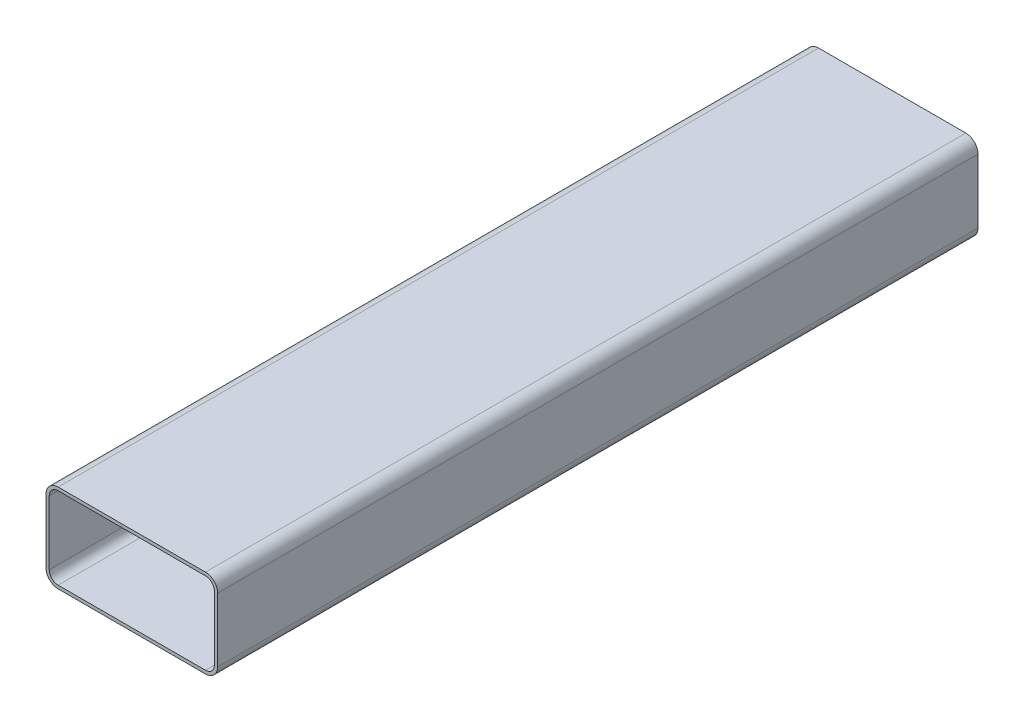
ISO-10303-21;
HEADER;
FILE_DESCRIPTION(('STEP AP214'),'2;1');
FILE_NAME('part.step','',(''),(''),'','','');
FILE_SCHEMA(('AUTOMOTIVE_DESIGN { 1 0 10303 214 1 1 1 1 }'));
ENDSEC;
DATA;
#1=APPLICATION_CONTEXT('core data for automotive mechanical design processes');
#2=APPLICATION_PROTOCOL_DEFINITION('international standard','automotive_design',2000,#1);
#3=PRODUCT_CONTEXT('',#1,'mechanical');
#4=PRODUCT('Part','Part','',(#3));
#5=PRODUCT_RELATED_PRODUCT_CATEGORY('part','',(#4));
#6=PRODUCT_DEFINITION_FORMATION('','',#4);
#7=PRODUCT_DEFINITION_CONTEXT('part definition',#1,'design');
#8=PRODUCT_DEFINITION('design','',#6,#7);
#9=PRODUCT_DEFINITION_SHAPE('','',#8);
#10=(LENGTH_UNIT() NAMED_UNIT(*) SI_UNIT(.MILLI.,.METRE.));
#11=(NAMED_UNIT(*) PLANE_ANGLE_UNIT() SI_UNIT($,.RADIAN.));
#12=(NAMED_UNIT(*) SI_UNIT($,.STERADIAN.) SOLID_ANGLE_UNIT());
#13=UNCERTAINTY_MEASURE_WITH_UNIT(LENGTH_MEASURE(1.E-05),#10,'distance_accuracy_value','');
#14=(GEOMETRIC_REPRESENTATION_CONTEXT(3) GLOBAL_UNCERTAINTY_ASSIGNED_CONTEXT((#13)) GLOBAL_UNIT_ASSIGNED_CONTEXT((#10,
#11,#12)) REPRESENTATION_CONTEXT('',''));
#15=CARTESIAN_POINT('',(0.,0.,0.));
#16=DIRECTION('',(0.,0.,1.));
#17=DIRECTION('',(1.,0.,0.));
#18=AXIS2_PLACEMENT_3D('',#15,#16,#17);
#19=CARTESIAN_POINT('',(49.2151,-21.364,508.));
#20=DIRECTION('',(0.,0.,1.));
#21=DIRECTION('',(1.,0.,0.));
#22=AXIS2_PLACEMENT_3D('',#19,#20,#21);
#23=PLANE('',#22);
#24=CARTESIAN_POINT('',(49.2151,-21.364,508.));
#25=DIRECTION('',(0.,0.,1.));
#26=DIRECTION('',(1.,0.,0.));
#27=AXIS2_PLACEMENT_3D('',#24,#25,#26);
#28=CIRCLE('',#27,8.10000000000001);
#29=CARTESIAN_POINT('',(49.2151,-29.464,508.));
#30=VERTEX_POINT('',#29);
#31=CARTESIAN_POINT('',(57.3151,-21.364,508.));
#32=VERTEX_POINT('',#31);
#33=EDGE_CURVE('E212',#30,#32,#28,.T.);
#34=ORIENTED_EDGE('',*,*,#33,.T.);
#35=DIRECTION('',(0.,1.,0.));
#36=VECTOR('',#35,1.);
#37=CARTESIAN_POINT('',(57.3151,-21.364,508.));
#38=LINE('',#37,#36);
#39=CARTESIAN_POINT('',(57.3151,21.364,508.));
#40=VERTEX_POINT('',#39);
#41=EDGE_CURVE('E215',#32,#40,#38,.T.);
#42=ORIENTED_EDGE('',*,*,#41,.T.);
#43=CARTESIAN_POINT('',(49.2151,21.364,508.));
#44=DIRECTION('',(0.,0.,1.));
#45=DIRECTION('',(-1.,0.,0.));
#46=AXIS2_PLACEMENT_3D('',#43,#44,#45);
#47=CIRCLE('',#46,8.10000000000001);
#48=CARTESIAN_POINT('',(49.2151,29.464,508.));
#49=VERTEX_POINT('',#48);
#50=EDGE_CURVE('E218',#40,#49,#47,.T.);
#51=ORIENTED_EDGE('',*,*,#50,.T.);
#52=DIRECTION('',(-1.,0.,0.));
#53=VECTOR('',#52,1.);
#54=CARTESIAN_POINT('',(-49.2151,29.464,508.));
#55=LINE('',#54,#53);
#56=CARTESIAN_POINT('',(-49.2151,29.464,508.));
#57=VERTEX_POINT('',#56);
#58=EDGE_CURVE('E220',#49,#57,#55,.T.);
#59=ORIENTED_EDGE('',*,*,#58,.T.);
#60=CARTESIAN_POINT('',(-49.2151,21.364,508.));
#61=DIRECTION('',(0.,0.,1.));
#62=DIRECTION('',(-1.,0.,0.));
#63=AXIS2_PLACEMENT_3D('',#60,#61,#62);
#64=CIRCLE('',#63,8.1);
#65=CARTESIAN_POINT('',(-57.3151,21.364,508.));
#66=VERTEX_POINT('',#65);
#67=EDGE_CURVE('E222',#57,#66,#64,.T.);
#68=ORIENTED_EDGE('',*,*,#67,.T.);
#69=DIRECTION('',(0.,-1.,0.));
#70=VECTOR('',#69,1.);
#71=CARTESIAN_POINT('',(-57.3151,-21.364,508.));
#72=LINE('',#71,#70);
#73=CARTESIAN_POINT('',(-57.3151,-21.364,508.));
#74=VERTEX_POINT('',#73);
#75=EDGE_CURVE('E224',#66,#74,#72,.T.);
#76=ORIENTED_EDGE('',*,*,#75,.T.);
#77=CARTESIAN_POINT('',(-49.2151,-21.364,508.));
#78=DIRECTION('',(0.,0.,1.));
#79=DIRECTION('',(-1.,0.,0.));
#80=AXIS2_PLACEMENT_3D('',#77,#78,#79);
#81=CIRCLE('',#80,8.1);
#82=CARTESIAN_POINT('',(-49.2151,-29.464,508.));
#83=VERTEX_POINT('',#82);
#84=EDGE_CURVE('E226',#74,#83,#81,.T.);
#85=ORIENTED_EDGE('',*,*,#84,.T.);
#86=DIRECTION('',(1.,0.,0.));
#87=VECTOR('',#86,1.);
#88=CARTESIAN_POINT('',(-49.2151,-29.464,508.));
#89=LINE('',#88,#87);
#90=EDGE_CURVE('E228',#83,#30,#89,.T.);
#91=ORIENTED_EDGE('',*,*,#90,.T.);
#92=EDGE_LOOP('',(#34,#42,#51,#59,#68,#76,#85,#91));
#93=FACE_BOUND('',#92,.T.);
#94=DIRECTION('',(0.,1.,0.));
#95=VECTOR('',#94,1.);
#96=CARTESIAN_POINT('',(55.1561,-21.365,508.));
#97=LINE('',#96,#95);
#98=CARTESIAN_POINT('',(55.1561,-21.365,508.));
#99=VERTEX_POINT('',#98);
#100=CARTESIAN_POINT('',(55.1561,21.365,508.));
#101=VERTEX_POINT('',#100);
#102=EDGE_CURVE('E155',#99,#101,#97,.T.);
#103=ORIENTED_EDGE('',*,*,#102,.F.);
#104=CARTESIAN_POINT('',(49.2161,-21.365,508.));
#105=DIRECTION('',(0.,0.,1.));
#106=DIRECTION('',(1.,0.,0.));
#107=AXIS2_PLACEMENT_3D('',#104,#105,#106);
#108=CIRCLE('',#107,5.94);
#109=CARTESIAN_POINT('',(49.2161,-27.305,508.));
#110=VERTEX_POINT('',#109);
#111=EDGE_CURVE('E147',#110,#99,#108,.T.);
#112=ORIENTED_EDGE('',*,*,#111,.F.);
#113=DIRECTION('',(1.,0.,0.));
#114=VECTOR('',#113,1.);
#115=CARTESIAN_POINT('',(-49.2161,-27.305,508.));
#116=LINE('',#115,#114);
#117=CARTESIAN_POINT('',(-49.2161,-27.305,508.));
#118=VERTEX_POINT('',#117);
#119=EDGE_CURVE('E180',#118,#110,#116,.T.);
#120=ORIENTED_EDGE('',*,*,#119,.F.);
#121=CARTESIAN_POINT('',(-49.2161,-21.365,508.));
#122=DIRECTION('',(0.,0.,1.));
#123=DIRECTION('',(-1.,0.,0.));
#124=AXIS2_PLACEMENT_3D('',#121,#122,#123);
#125=CIRCLE('',#124,5.94);
#126=CARTESIAN_POINT('',(-55.1561,-21.365,508.));
#127=VERTEX_POINT('',#126);
#128=EDGE_CURVE('E178',#127,#118,#125,.T.);
#129=ORIENTED_EDGE('',*,*,#128,.F.);
#130=DIRECTION('',(0.,-1.,0.));
#131=VECTOR('',#130,1.);
#132=CARTESIAN_POINT('',(-55.1561,-21.365,508.));
#133=LINE('',#132,#131);
#134=CARTESIAN_POINT('',(-55.1561,21.365,508.));
#135=VERTEX_POINT('',#134);
#136=EDGE_CURVE('E176',#135,#127,#133,.T.);
#137=ORIENTED_EDGE('',*,*,#136,.F.);
#138=CARTESIAN_POINT('',(-49.2161,21.365,508.));
#139=DIRECTION('',(0.,0.,1.));
#140=DIRECTION('',(-1.,0.,0.));
#141=AXIS2_PLACEMENT_3D('',#138,#139,#140);
#142=CIRCLE('',#141,5.94);
#143=CARTESIAN_POINT('',(-49.2161,27.305,508.));
#144=VERTEX_POINT('',#143);
#145=EDGE_CURVE('E174',#144,#135,#142,.T.);
#146=ORIENTED_EDGE('',*,*,#145,.F.);
#147=DIRECTION('',(-1.,0.,0.));
#148=VECTOR('',#147,1.);
#149=CARTESIAN_POINT('',(-49.2161,27.305,508.));
#150=LINE('',#149,#148);
#151=CARTESIAN_POINT('',(49.2161,27.305,508.));
#152=VERTEX_POINT('',#151);
#153=EDGE_CURVE('E170',#152,#144,#150,.T.);
#154=ORIENTED_EDGE('',*,*,#153,.F.);
#155=CARTESIAN_POINT('',(49.2161,21.365,508.));
#156=DIRECTION('',(0.,0.,1.));
#157=DIRECTION('',(-1.,0.,0.));
#158=AXIS2_PLACEMENT_3D('',#155,#156,#157);
#159=CIRCLE('',#158,5.94);
#160=EDGE_CURVE('E168',#101,#152,#159,.T.);
#161=ORIENTED_EDGE('',*,*,#160,.F.);
#162=EDGE_LOOP('',(#103,#112,#120,#129,#137,#146,#154,#161));
#163=FACE_BOUND('',#162,.T.);
#164=ADVANCED_FACE('F34',(#93,#163),#23,.T.);
#165=CARTESIAN_POINT('',(49.2151,-21.364,0.));
#166=DIRECTION('',(0.,0.,1.));
#167=DIRECTION('',(1.,0.,0.));
#168=AXIS2_PLACEMENT_3D('',#165,#166,#167);
#169=PLANE('',#168);
#170=CARTESIAN_POINT('',(49.2151,-21.364,0.));
#171=DIRECTION('',(0.,0.,1.));
#172=DIRECTION('',(1.,0.,0.));
#173=AXIS2_PLACEMENT_3D('',#170,#171,#172);
#174=CIRCLE('',#173,8.10000000000001);
#175=CARTESIAN_POINT('',(49.2151,-29.464,0.));
#176=VERTEX_POINT('',#175);
#177=CARTESIAN_POINT('',(57.3151,-21.364,0.));
#178=VERTEX_POINT('',#177);
#179=EDGE_CURVE('E163',#176,#178,#174,.T.);
#180=ORIENTED_EDGE('',*,*,#179,.F.);
#181=DIRECTION('',(1.,0.,0.));
#182=VECTOR('',#181,1.);
#183=CARTESIAN_POINT('',(-49.2151,-29.464,0.));
#184=LINE('',#183,#182);
#185=CARTESIAN_POINT('',(-49.2151,-29.464,0.));
#186=VERTEX_POINT('',#185);
#187=EDGE_CURVE('E216',#186,#176,#184,.T.);
#188=ORIENTED_EDGE('',*,*,#187,.F.);
#189=CARTESIAN_POINT('',(-49.2151,-21.364,0.));
#190=DIRECTION('',(0.,0.,1.));
#191=DIRECTION('',(-1.,0.,0.));
#192=AXIS2_PLACEMENT_3D('',#189,#190,#191);
#193=CIRCLE('',#192,8.1);
#194=CARTESIAN_POINT('',(-57.3151,-21.364,0.));
#195=VERTEX_POINT('',#194);
#196=EDGE_CURVE('E243',#195,#186,#193,.T.);
#197=ORIENTED_EDGE('',*,*,#196,.F.);
#198=DIRECTION('',(0.,-1.,0.));
#199=VECTOR('',#198,1.);
#200=CARTESIAN_POINT('',(-57.3151,-21.364,0.));
#201=LINE('',#200,#199);
#202=CARTESIAN_POINT('',(-57.3151,21.364,0.));
#203=VERTEX_POINT('',#202);
#204=EDGE_CURVE('E241',#203,#195,#201,.T.);
#205=ORIENTED_EDGE('',*,*,#204,.F.);
#206=CARTESIAN_POINT('',(-49.2151,21.364,0.));
#207=DIRECTION('',(0.,0.,1.));
#208=DIRECTION('',(-1.,0.,0.));
#209=AXIS2_PLACEMENT_3D('',#206,#207,#208);
#210=CIRCLE('',#209,8.1);
#211=CARTESIAN_POINT('',(-49.2151,29.464,0.));
#212=VERTEX_POINT('',#211);
#213=EDGE_CURVE('E239',#212,#203,#210,.T.);
#214=ORIENTED_EDGE('',*,*,#213,.F.);
#215=DIRECTION('',(-1.,0.,0.));
#216=VECTOR('',#215,1.);
#217=CARTESIAN_POINT('',(-49.2151,29.464,0.));
#218=LINE('',#217,#216);
#219=CARTESIAN_POINT('',(49.2151,29.464,0.));
#220=VERTEX_POINT('',#219);
#221=EDGE_CURVE('E237',#220,#212,#218,.T.);
#222=ORIENTED_EDGE('',*,*,#221,.F.);
#223=CARTESIAN_POINT('',(49.2151,21.364,0.));
#224=DIRECTION('',(0.,0.,1.));
#225=DIRECTION('',(-1.,0.,0.));
#226=AXIS2_PLACEMENT_3D('',#223,#224,#225);
#227=CIRCLE('',#226,8.10000000000001);
#228=CARTESIAN_POINT('',(57.3151,21.364,0.));
#229=VERTEX_POINT('',#228);
#230=EDGE_CURVE('E235',#229,#220,#227,.T.);
#231=ORIENTED_EDGE('',*,*,#230,.F.);
#232=DIRECTION('',(0.,1.,0.));
#233=VECTOR('',#232,1.);
#234=CARTESIAN_POINT('',(57.3151,-21.364,0.));
#235=LINE('',#234,#233);
#236=EDGE_CURVE('E233',#178,#229,#235,.T.);
#237=ORIENTED_EDGE('',*,*,#236,.F.);
#238=EDGE_LOOP('',(#180,#188,#197,#205,#214,#222,#231,#237));
#239=FACE_BOUND('',#238,.T.);
#240=CARTESIAN_POINT('',(49.2161,-21.365,0.));
#241=DIRECTION('',(0.,0.,1.));
#242=DIRECTION('',(1.,0.,0.));
#243=AXIS2_PLACEMENT_3D('',#240,#241,#242);
#244=CIRCLE('',#243,5.94);
#245=CARTESIAN_POINT('',(49.2161,-27.305,0.));
#246=VERTEX_POINT('',#245);
#247=CARTESIAN_POINT('',(55.1561,-21.365,0.));
#248=VERTEX_POINT('',#247);
#249=EDGE_CURVE('E57',#246,#248,#244,.T.);
#250=ORIENTED_EDGE('',*,*,#249,.T.);
#251=DIRECTION('',(0.,1.,0.));
#252=VECTOR('',#251,1.);
#253=CARTESIAN_POINT('',(55.1561,-21.365,0.));
#254=LINE('',#253,#252);
#255=CARTESIAN_POINT('',(55.1561,21.365,0.));
#256=VERTEX_POINT('',#255);
#257=EDGE_CURVE('E162',#248,#256,#254,.T.);
#258=ORIENTED_EDGE('',*,*,#257,.T.);
#259=CARTESIAN_POINT('',(49.2161,21.365,0.));
#260=DIRECTION('',(0.,0.,1.));
#261=DIRECTION('',(-1.,0.,0.));
#262=AXIS2_PLACEMENT_3D('',#259,#260,#261);
#263=CIRCLE('',#262,5.94);
#264=CARTESIAN_POINT('',(49.2161,27.305,0.));
#265=VERTEX_POINT('',#264);
#266=EDGE_CURVE('E184',#256,#265,#263,.T.);
#267=ORIENTED_EDGE('',*,*,#266,.T.);
#268=DIRECTION('',(-1.,0.,0.));
#269=VECTOR('',#268,1.);
#270=CARTESIAN_POINT('',(-49.2161,27.305,0.));
#271=LINE('',#270,#269);
#272=CARTESIAN_POINT('',(-49.2161,27.305,0.));
#273=VERTEX_POINT('',#272);
#274=EDGE_CURVE('E187',#265,#273,#271,.T.);
#275=ORIENTED_EDGE('',*,*,#274,.T.);
#276=CARTESIAN_POINT('',(-49.2161,21.365,0.));
#277=DIRECTION('',(0.,0.,1.));
#278=DIRECTION('',(-1.,0.,0.));
#279=AXIS2_PLACEMENT_3D('',#276,#277,#278);
#280=CIRCLE('',#279,5.94);
#281=CARTESIAN_POINT('',(-55.1561,21.365,0.));
#282=VERTEX_POINT('',#281);
#283=EDGE_CURVE('E190',#273,#282,#280,.T.);
#284=ORIENTED_EDGE('',*,*,#283,.T.);
#285=DIRECTION('',(0.,-1.,0.));
#286=VECTOR('',#285,1.);
#287=CARTESIAN_POINT('',(-55.1561,-21.365,0.));
#288=LINE('',#287,#286);
#289=CARTESIAN_POINT('',(-55.1561,-21.365,0.));
#290=VERTEX_POINT('',#289);
#291=EDGE_CURVE('E193',#282,#290,#288,.T.);
#292=ORIENTED_EDGE('',*,*,#291,.T.);
#293=CARTESIAN_POINT('',(-49.2161,-21.365,0.));
#294=DIRECTION('',(0.,0.,1.));
#295=DIRECTION('',(-1.,0.,0.));
#296=AXIS2_PLACEMENT_3D('',#293,#294,#295);
#297=CIRCLE('',#296,5.94);
#298=CARTESIAN_POINT('',(-49.2161,-27.305,0.));
#299=VERTEX_POINT('',#298);
#300=EDGE_CURVE('E196',#290,#299,#297,.T.);
#301=ORIENTED_EDGE('',*,*,#300,.T.);
#302=DIRECTION('',(1.,0.,0.));
#303=VECTOR('',#302,1.);
#304=CARTESIAN_POINT('',(-49.2161,-27.305,0.));
#305=LINE('',#304,#303);
#306=EDGE_CURVE('E156',#299,#246,#305,.T.);
#307=ORIENTED_EDGE('',*,*,#306,.T.);
#308=EDGE_LOOP('',(#250,#258,#267,#275,#284,#292,#301,#307));
#309=FACE_BOUND('',#308,.T.);
#310=ADVANCED_FACE('F273',(#239,#309),#169,.F.);
#311=CARTESIAN_POINT('',(49.2151,-21.364,508.));
#312=DIRECTION('',(0.,0.,-1.));
#313=DIRECTION('',(-1.,0.,0.));
#314=AXIS2_PLACEMENT_3D('',#311,#312,#313);
#315=CYLINDRICAL_SURFACE('',#314,8.10000000000001);
#316=ORIENTED_EDGE('',*,*,#179,.T.);
#317=DIRECTION('',(0.,0.,-1.));
#318=VECTOR('',#317,1.);
#319=CARTESIAN_POINT('',(57.3151,-21.364,508.));
#320=LINE('',#319,#318);
#321=EDGE_CURVE('E11',#32,#178,#320,.T.);
#322=ORIENTED_EDGE('',*,*,#321,.F.);
#323=ORIENTED_EDGE('',*,*,#33,.F.);
#324=DIRECTION('',(0.,0.,-1.));
#325=VECTOR('',#324,1.);
#326=CARTESIAN_POINT('',(49.2151,-29.464,508.));
#327=LINE('',#326,#325);
#328=EDGE_CURVE('E230',#30,#176,#327,.T.);
#329=ORIENTED_EDGE('',*,*,#328,.T.);
#330=EDGE_LOOP('',(#316,#322,#323,#329));
#331=FACE_BOUND('',#330,.T.);
#332=ADVANCED_FACE('F36',(#331),#315,.T.);
#333=CARTESIAN_POINT('',(57.3151,-21.364,508.));
#334=DIRECTION('',(-1.,0.,0.));
#335=DIRECTION('',(0.,0.,1.));
#336=AXIS2_PLACEMENT_3D('',#333,#334,#335);
#337=PLANE('',#336);
#338=ORIENTED_EDGE('',*,*,#236,.T.);
#339=DIRECTION('',(0.,0.,-1.));
#340=VECTOR('',#339,1.);
#341=CARTESIAN_POINT('',(57.3151,21.364,508.));
#342=LINE('',#341,#340);
#343=EDGE_CURVE('E42',#40,#229,#342,.T.);
#344=ORIENTED_EDGE('',*,*,#343,.F.);
#345=ORIENTED_EDGE('',*,*,#41,.F.);
#346=ORIENTED_EDGE('',*,*,#321,.T.);
#347=EDGE_LOOP('',(#338,#344,#345,#346));
#348=FACE_BOUND('',#347,.T.);
#349=ADVANCED_FACE('F290',(#348),#337,.F.);
#350=CARTESIAN_POINT('',(49.2151,21.364,508.));
#351=DIRECTION('',(0.,0.,-1.));
#352=DIRECTION('',(-1.,0.,0.));
#353=AXIS2_PLACEMENT_3D('',#350,#351,#352);
#354=CYLINDRICAL_SURFACE('',#353,8.10000000000001);
#355=ORIENTED_EDGE('',*,*,#230,.T.);
#356=DIRECTION('',(0.,0.,-1.));
#357=VECTOR('',#356,1.);
#358=CARTESIAN_POINT('',(49.2151,29.464,508.));
#359=LINE('',#358,#357);
#360=EDGE_CURVE('E260',#49,#220,#359,.T.);
#361=ORIENTED_EDGE('',*,*,#360,.F.);
#362=ORIENTED_EDGE('',*,*,#50,.F.);
#363=ORIENTED_EDGE('',*,*,#343,.T.);
#364=EDGE_LOOP('',(#355,#361,#362,#363));
#365=FACE_BOUND('',#364,.T.);
#366=ADVANCED_FACE('F267',(#365),#354,.T.);
#367=CARTESIAN_POINT('',(-49.2151,29.464,508.));
#368=DIRECTION('',(0.,-1.,0.));
#369=DIRECTION('',(1.,0.,0.));
#370=AXIS2_PLACEMENT_3D('',#367,#368,#369);
#371=PLANE('',#370);
#372=ORIENTED_EDGE('',*,*,#221,.T.);
#373=DIRECTION('',(0.,0.,-1.));
#374=VECTOR('',#373,1.);
#375=CARTESIAN_POINT('',(-49.2151,29.464,508.));
#376=LINE('',#375,#374);
#377=EDGE_CURVE('E257',#57,#212,#376,.T.);
#378=ORIENTED_EDGE('',*,*,#377,.F.);
#379=ORIENTED_EDGE('',*,*,#58,.F.);
#380=ORIENTED_EDGE('',*,*,#360,.T.);
#381=EDGE_LOOP('',(#372,#378,#379,#380));
#382=FACE_BOUND('',#381,.T.);
#383=ADVANCED_FACE('F279',(#382),#371,.F.);
#384=CARTESIAN_POINT('',(-49.2151,21.364,508.));
#385=DIRECTION('',(0.,0.,-1.));
#386=DIRECTION('',(-1.,0.,0.));
#387=AXIS2_PLACEMENT_3D('',#384,#385,#386);
#388=CYLINDRICAL_SURFACE('',#387,8.1);
#389=ORIENTED_EDGE('',*,*,#213,.T.);
#390=DIRECTION('',(0.,0.,-1.));
#391=VECTOR('',#390,1.);
#392=CARTESIAN_POINT('',(-57.3151,21.364,508.));
#393=LINE('',#392,#391);
#394=EDGE_CURVE('E254',#66,#203,#393,.T.);
#395=ORIENTED_EDGE('',*,*,#394,.F.);
#396=ORIENTED_EDGE('',*,*,#67,.F.);
#397=ORIENTED_EDGE('',*,*,#377,.T.);
#398=EDGE_LOOP('',(#389,#395,#396,#397));
#399=FACE_BOUND('',#398,.T.);
#400=ADVANCED_FACE('F283',(#399),#388,.T.);
#401=CARTESIAN_POINT('',(-57.3151,-21.364,508.));
#402=DIRECTION('',(1.,0.,0.));
#403=DIRECTION('',(0.,0.,-1.));
#404=AXIS2_PLACEMENT_3D('',#401,#402,#403);
#405=PLANE('',#404);
#406=ORIENTED_EDGE('',*,*,#204,.T.);
#407=DIRECTION('',(0.,0.,-1.));
#408=VECTOR('',#407,1.);
#409=CARTESIAN_POINT('',(-57.3151,-21.364,508.));
#410=LINE('',#409,#408);
#411=EDGE_CURVE('E251',#74,#195,#410,.T.);
#412=ORIENTED_EDGE('',*,*,#411,.F.);
#413=ORIENTED_EDGE('',*,*,#75,.F.);
#414=ORIENTED_EDGE('',*,*,#394,.T.);
#415=EDGE_LOOP('',(#406,#412,#413,#414));
#416=FACE_BOUND('',#415,.T.);
#417=ADVANCED_FACE('F303',(#416),#405,.F.);
#418=CARTESIAN_POINT('',(-49.2151,-21.364,508.));
#419=DIRECTION('',(0.,0.,-1.));
#420=DIRECTION('',(-1.,0.,0.));
#421=AXIS2_PLACEMENT_3D('',#418,#419,#420);
#422=CYLINDRICAL_SURFACE('',#421,8.1);
#423=ORIENTED_EDGE('',*,*,#196,.T.);
#424=DIRECTION('',(0.,0.,-1.));
#425=VECTOR('',#424,1.);
#426=CARTESIAN_POINT('',(-49.2151,-29.464,508.));
#427=LINE('',#426,#425);
#428=EDGE_CURVE('E248',#83,#186,#427,.T.);
#429=ORIENTED_EDGE('',*,*,#428,.F.);
#430=ORIENTED_EDGE('',*,*,#84,.F.);
#431=ORIENTED_EDGE('',*,*,#411,.T.);
#432=EDGE_LOOP('',(#423,#429,#430,#431));
#433=FACE_BOUND('',#432,.T.);
#434=ADVANCED_FACE('F301',(#433),#422,.T.);
#435=CARTESIAN_POINT('',(-49.2151,-29.464,508.));
#436=DIRECTION('',(0.,1.,0.));
#437=DIRECTION('',(0.,0.,1.));
#438=AXIS2_PLACEMENT_3D('',#435,#436,#437);
#439=PLANE('',#438);
#440=ORIENTED_EDGE('',*,*,#187,.T.);
#441=ORIENTED_EDGE('',*,*,#328,.F.);
#442=ORIENTED_EDGE('',*,*,#90,.F.);
#443=ORIENTED_EDGE('',*,*,#428,.T.);
#444=EDGE_LOOP('',(#440,#441,#442,#443));
#445=FACE_BOUND('',#444,.T.);
#446=ADVANCED_FACE('F296',(#445),#439,.F.);
#447=CARTESIAN_POINT('',(49.2161,-21.365,508.));
#448=DIRECTION('',(0.,0.,-1.));
#449=DIRECTION('',(-1.,0.,0.));
#450=AXIS2_PLACEMENT_3D('',#447,#448,#449);
#451=CYLINDRICAL_SURFACE('',#450,5.94);
#452=ORIENTED_EDGE('',*,*,#249,.F.);
#453=DIRECTION('',(0.,0.,-1.));
#454=VECTOR('',#453,1.);
#455=CARTESIAN_POINT('',(49.2161,-27.305,508.));
#456=LINE('',#455,#454);
#457=EDGE_CURVE('E151',#110,#246,#456,.T.);
#458=ORIENTED_EDGE('',*,*,#457,.F.);
#459=ORIENTED_EDGE('',*,*,#111,.T.);
#460=DIRECTION('',(0.,0.,-1.));
#461=VECTOR('',#460,1.);
#462=CARTESIAN_POINT('',(55.1561,-21.365,508.));
#463=LINE('',#462,#461);
#464=EDGE_CURVE('E150',#99,#248,#463,.T.);
#465=ORIENTED_EDGE('',*,*,#464,.T.);
#466=EDGE_LOOP('',(#452,#458,#459,#465));
#467=FACE_BOUND('',#466,.T.);
#468=ADVANCED_FACE('F149',(#467),#451,.F.);
#469=CARTESIAN_POINT('',(55.1561,-21.365,508.));
#470=DIRECTION('',(-1.,0.,0.));
#471=DIRECTION('',(0.,0.,1.));
#472=AXIS2_PLACEMENT_3D('',#469,#470,#471);
#473=PLANE('',#472);
#474=ORIENTED_EDGE('',*,*,#257,.F.);
#475=ORIENTED_EDGE('',*,*,#464,.F.);
#476=ORIENTED_EDGE('',*,*,#102,.T.);
#477=DIRECTION('',(0.,0.,-1.));
#478=VECTOR('',#477,1.);
#479=CARTESIAN_POINT('',(55.1561,21.365,508.));
#480=LINE('',#479,#478);
#481=EDGE_CURVE('E164',#101,#256,#480,.T.);
#482=ORIENTED_EDGE('',*,*,#481,.T.);
#483=EDGE_LOOP('',(#474,#475,#476,#482));
#484=FACE_BOUND('',#483,.T.);
#485=ADVANCED_FACE('F159',(#484),#473,.T.);
#486=CARTESIAN_POINT('',(49.2161,21.365,508.));
#487=DIRECTION('',(0.,0.,-1.));
#488=DIRECTION('',(-1.,0.,0.));
#489=AXIS2_PLACEMENT_3D('',#486,#487,#488);
#490=CYLINDRICAL_SURFACE('',#489,5.94);
#491=ORIENTED_EDGE('',*,*,#266,.F.);
#492=ORIENTED_EDGE('',*,*,#481,.F.);
#493=ORIENTED_EDGE('',*,*,#160,.T.);
#494=DIRECTION('',(0.,0.,-1.));
#495=VECTOR('',#494,1.);
#496=CARTESIAN_POINT('',(49.2161,27.305,508.));
#497=LINE('',#496,#495);
#498=EDGE_CURVE('E209',#152,#265,#497,.T.);
#499=ORIENTED_EDGE('',*,*,#498,.T.);
#500=EDGE_LOOP('',(#491,#492,#493,#499));
#501=FACE_BOUND('',#500,.T.);
#502=ADVANCED_FACE('F328',(#501),#490,.F.);
#503=CARTESIAN_POINT('',(-49.2161,27.305,508.));
#504=DIRECTION('',(0.,-1.,0.));
#505=DIRECTION('',(0.,0.,-1.));
#506=AXIS2_PLACEMENT_3D('',#503,#504,#505);
#507=PLANE('',#506);
#508=ORIENTED_EDGE('',*,*,#274,.F.);
#509=ORIENTED_EDGE('',*,*,#498,.F.);
#510=ORIENTED_EDGE('',*,*,#153,.T.);
#511=DIRECTION('',(0.,0.,-1.));
#512=VECTOR('',#511,1.);
#513=CARTESIAN_POINT('',(-49.2161,27.305,508.));
#514=LINE('',#513,#512);
#515=EDGE_CURVE('E207',#144,#273,#514,.T.);
#516=ORIENTED_EDGE('',*,*,#515,.T.);
#517=EDGE_LOOP('',(#508,#509,#510,#516));
#518=FACE_BOUND('',#517,.T.);
#519=ADVANCED_FACE('F332',(#518),#507,.T.);
#520=CARTESIAN_POINT('',(-49.2161,21.365,508.));
#521=DIRECTION('',(0.,0.,-1.));
#522=DIRECTION('',(-1.,0.,0.));
#523=AXIS2_PLACEMENT_3D('',#520,#521,#522);
#524=CYLINDRICAL_SURFACE('',#523,5.94);
#525=ORIENTED_EDGE('',*,*,#283,.F.);
#526=ORIENTED_EDGE('',*,*,#515,.F.);
#527=ORIENTED_EDGE('',*,*,#145,.T.);
#528=DIRECTION('',(0.,0.,-1.));
#529=VECTOR('',#528,1.);
#530=CARTESIAN_POINT('',(-55.1561,21.365,508.));
#531=LINE('',#530,#529);
#532=EDGE_CURVE('E205',#135,#282,#531,.T.);
#533=ORIENTED_EDGE('',*,*,#532,.T.);
#534=EDGE_LOOP('',(#525,#526,#527,#533));
#535=FACE_BOUND('',#534,.T.);
#536=ADVANCED_FACE('F338',(#535),#524,.F.);
#537=CARTESIAN_POINT('',(-55.1561,-21.365,508.));
#538=DIRECTION('',(1.,0.,0.));
#539=DIRECTION('',(0.,0.,-1.));
#540=AXIS2_PLACEMENT_3D('',#537,#538,#539);
#541=PLANE('',#540);
#542=ORIENTED_EDGE('',*,*,#291,.F.);
#543=ORIENTED_EDGE('',*,*,#532,.F.);
#544=ORIENTED_EDGE('',*,*,#136,.T.);
#545=DIRECTION('',(0.,0.,-1.));
#546=VECTOR('',#545,1.);
#547=CARTESIAN_POINT('',(-55.1561,-21.365,508.));
#548=LINE('',#547,#546);
#549=EDGE_CURVE('E203',#127,#290,#548,.T.);
#550=ORIENTED_EDGE('',*,*,#549,.T.);
#551=EDGE_LOOP('',(#542,#543,#544,#550));
#552=FACE_BOUND('',#551,.T.);
#553=ADVANCED_FACE('F342',(#552),#541,.T.);
#554=CARTESIAN_POINT('',(-49.2161,-21.365,508.));
#555=DIRECTION('',(0.,0.,-1.));
#556=DIRECTION('',(-1.,0.,0.));
#557=AXIS2_PLACEMENT_3D('',#554,#555,#556);
#558=CYLINDRICAL_SURFACE('',#557,5.94);
#559=ORIENTED_EDGE('',*,*,#300,.F.);
#560=ORIENTED_EDGE('',*,*,#549,.F.);
#561=ORIENTED_EDGE('',*,*,#128,.T.);
#562=DIRECTION('',(0.,0.,-1.));
#563=VECTOR('',#562,1.);
#564=CARTESIAN_POINT('',(-49.2161,-27.305,508.));
#565=LINE('',#564,#563);
#566=EDGE_CURVE('E49',#118,#299,#565,.T.);
#567=ORIENTED_EDGE('',*,*,#566,.T.);
#568=EDGE_LOOP('',(#559,#560,#561,#567));
#569=FACE_BOUND('',#568,.T.);
#570=ADVANCED_FACE('F346',(#569),#558,.F.);
#571=CARTESIAN_POINT('',(-49.2161,-27.305,508.));
#572=DIRECTION('',(0.,1.,0.));
#573=DIRECTION('',(0.,0.,1.));
#574=AXIS2_PLACEMENT_3D('',#571,#572,#573);
#575=PLANE('',#574);
#576=ORIENTED_EDGE('',*,*,#306,.F.);
#577=ORIENTED_EDGE('',*,*,#566,.F.);
#578=ORIENTED_EDGE('',*,*,#119,.T.);
#579=ORIENTED_EDGE('',*,*,#457,.T.);
#580=EDGE_LOOP('',(#576,#577,#578,#579));
#581=FACE_BOUND('',#580,.T.);
#582=ADVANCED_FACE('F350',(#581),#575,.T.);
#583=CLOSED_SHELL('',(#164,#310,#332,#349,#366,#383,#400,#417,#434,#446,#468,#485,#502,#519,
#536,#553,#570,#582));
#584=MANIFOLD_SOLID_BREP('B2',#583);
#585=ADVANCED_BREP_SHAPE_REPRESENTATION('',(#18,#584),#14);
#586=SHAPE_DEFINITION_REPRESENTATION(#9,#585);
ENDSEC;
END-ISO-10303-21;
